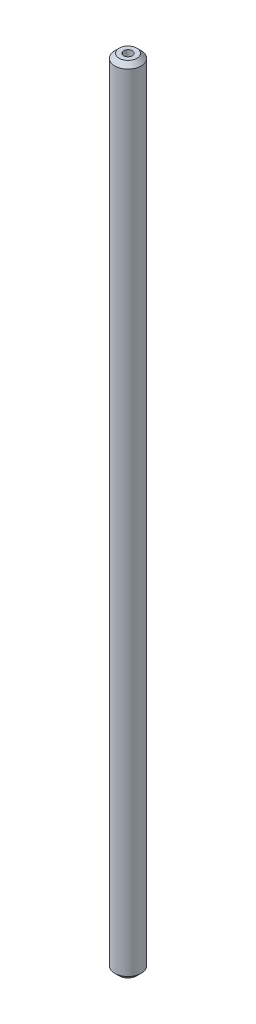
ISO-10303-21;
HEADER;
FILE_DESCRIPTION(('STEP AP214'),'2;1');
FILE_NAME('part.step','',(''),(''),'','','');
FILE_SCHEMA(('AUTOMOTIVE_DESIGN { 1 0 10303 214 1 1 1 1 }'));
ENDSEC;
DATA;
#1=APPLICATION_CONTEXT('core data for automotive mechanical design processes');
#2=APPLICATION_PROTOCOL_DEFINITION('international standard','automotive_design',2000,#1);
#3=PRODUCT_CONTEXT('',#1,'mechanical');
#4=PRODUCT('Part','Part','',(#3));
#5=PRODUCT_RELATED_PRODUCT_CATEGORY('part','',(#4));
#6=PRODUCT_DEFINITION_FORMATION('','',#4);
#7=PRODUCT_DEFINITION_CONTEXT('part definition',#1,'design');
#8=PRODUCT_DEFINITION('design','',#6,#7);
#9=PRODUCT_DEFINITION_SHAPE('','',#8);
#10=(LENGTH_UNIT() NAMED_UNIT(*) SI_UNIT(.MILLI.,.METRE.));
#11=(NAMED_UNIT(*) PLANE_ANGLE_UNIT() SI_UNIT($,.RADIAN.));
#12=(NAMED_UNIT(*) SI_UNIT($,.STERADIAN.) SOLID_ANGLE_UNIT());
#13=UNCERTAINTY_MEASURE_WITH_UNIT(LENGTH_MEASURE(1.E-05),#10,'distance_accuracy_value','');
#14=(GEOMETRIC_REPRESENTATION_CONTEXT(3) GLOBAL_UNCERTAINTY_ASSIGNED_CONTEXT((#13)) GLOBAL_UNIT_ASSIGNED_CONTEXT((#10,
#11,#12)) REPRESENTATION_CONTEXT('',''));
#15=CARTESIAN_POINT('',(0.,0.,0.));
#16=DIRECTION('',(0.,0.,1.));
#17=DIRECTION('',(1.,0.,0.));
#18=AXIS2_PLACEMENT_3D('',#15,#16,#17);
#19=CARTESIAN_POINT('',(0.,90.,0.));
#20=DIRECTION('',(0.,1.,0.));
#21=DIRECTION('',(0.,0.,1.));
#22=AXIS2_PLACEMENT_3D('',#19,#20,#21);
#23=PLANE('',#22);
#24=CARTESIAN_POINT('',(0.,90.,0.));
#25=DIRECTION('',(0.,1.,0.));
#26=DIRECTION('',(0.,0.,1.));
#27=AXIS2_PLACEMENT_3D('',#24,#25,#26);
#28=CIRCLE('',#27,1.00000000000006);
#29=CARTESIAN_POINT('',(0.,90.,1.00000000000006));
#30=VERTEX_POINT('',#29);
#31=EDGE_CURVE('E66',#30,#30,#28,.T.);
#32=ORIENTED_EDGE('',*,*,#31,.T.);
#33=EDGE_LOOP('',(#32));
#34=FACE_BOUND('',#33,.T.);
#35=CARTESIAN_POINT('',(0.,90.,0.));
#36=DIRECTION('',(0.,1.,0.));
#37=DIRECTION('',(0.,0.,1.));
#38=AXIS2_PLACEMENT_3D('',#35,#36,#37);
#39=CIRCLE('',#38,0.5);
#40=CARTESIAN_POINT('',(0.,90.,0.5));
#41=VERTEX_POINT('',#40);
#42=EDGE_CURVE('E72',#41,#41,#39,.T.);
#43=ORIENTED_EDGE('',*,*,#42,.F.);
#44=EDGE_LOOP('',(#43));
#45=FACE_BOUND('',#44,.T.);
#46=ADVANCED_FACE('F47',(#34,#45),#23,.T.);
#47=CARTESIAN_POINT('',(0.,0.,0.));
#48=DIRECTION('',(0.,1.,0.));
#49=DIRECTION('',(0.,0.,1.));
#50=AXIS2_PLACEMENT_3D('',#47,#48,#49);
#51=PLANE('',#50);
#52=CARTESIAN_POINT('',(0.,0.,0.));
#53=DIRECTION('',(0.,1.,0.));
#54=DIRECTION('',(0.,0.,1.));
#55=AXIS2_PLACEMENT_3D('',#52,#53,#54);
#56=CIRCLE('',#55,0.999999999999945);
#57=CARTESIAN_POINT('',(0.,0.,0.999999999999945));
#58=VERTEX_POINT('',#57);
#59=EDGE_CURVE('E10',#58,#58,#56,.F.);
#60=ORIENTED_EDGE('',*,*,#59,.T.);
#61=EDGE_LOOP('',(#60));
#62=FACE_BOUND('',#61,.T.);
#63=CARTESIAN_POINT('',(0.,0.,0.));
#64=DIRECTION('',(0.,1.,0.));
#65=DIRECTION('',(0.,0.,1.));
#66=AXIS2_PLACEMENT_3D('',#63,#64,#65);
#67=CIRCLE('',#66,0.5);
#68=CARTESIAN_POINT('',(0.,0.,0.5));
#69=VERTEX_POINT('',#68);
#70=EDGE_CURVE('E73',#69,#69,#67,.T.);
#71=ORIENTED_EDGE('',*,*,#70,.T.);
#72=EDGE_LOOP('',(#71));
#73=FACE_BOUND('',#72,.T.);
#74=ADVANCED_FACE('F85',(#62,#73),#51,.F.);
#75=CARTESIAN_POINT('',(0.,90.,0.));
#76=DIRECTION('',(0.,-1.,0.));
#77=DIRECTION('',(0.,0.,-1.));
#78=AXIS2_PLACEMENT_3D('',#75,#76,#77);
#79=CYLINDRICAL_SURFACE('',#78,1.5);
#80=CARTESIAN_POINT('',(0.,89.5000000000001,0.));
#81=DIRECTION('',(0.,1.,0.));
#82=DIRECTION('',(0.,0.,1.));
#83=AXIS2_PLACEMENT_3D('',#80,#81,#82);
#84=CIRCLE('',#83,1.5);
#85=CARTESIAN_POINT('',(0.,89.5000000000001,1.5));
#86=VERTEX_POINT('',#85);
#87=EDGE_CURVE('E56',#86,#86,#84,.F.);
#88=ORIENTED_EDGE('',*,*,#87,.T.);
#89=EDGE_LOOP('',(#88));
#90=FACE_BOUND('',#89,.T.);
#91=CARTESIAN_POINT('',(0.,0.500000000000056,0.));
#92=DIRECTION('',(0.,1.,0.));
#93=DIRECTION('',(0.,0.,1.));
#94=AXIS2_PLACEMENT_3D('',#91,#92,#93);
#95=CIRCLE('',#94,1.5);
#96=CARTESIAN_POINT('',(0.,0.500000000000056,1.5));
#97=VERTEX_POINT('',#96);
#98=EDGE_CURVE('E61',#97,#97,#95,.T.);
#99=ORIENTED_EDGE('',*,*,#98,.T.);
#100=EDGE_LOOP('',(#99));
#101=FACE_BOUND('',#100,.T.);
#102=ADVANCED_FACE('F92',(#90,#101),#79,.T.);
#103=CARTESIAN_POINT('',(0.,90.,0.));
#104=DIRECTION('',(0.,-1.,0.));
#105=DIRECTION('',(0.,0.,-1.));
#106=AXIS2_PLACEMENT_3D('',#103,#104,#105);
#107=CYLINDRICAL_SURFACE('',#106,0.5);
#108=ORIENTED_EDGE('',*,*,#42,.T.);
#109=EDGE_LOOP('',(#108));
#110=FACE_BOUND('',#109,.T.);
#111=ORIENTED_EDGE('',*,*,#70,.F.);
#112=EDGE_LOOP('',(#111));
#113=FACE_BOUND('',#112,.T.);
#114=ADVANCED_FACE('F81',(#110,#113),#107,.F.);
#115=CARTESIAN_POINT('',(0.,90.,0.));
#116=DIRECTION('',(0.,-1.,0.));
#117=DIRECTION('',(0.,0.,-1.));
#118=AXIS2_PLACEMENT_3D('',#115,#116,#117);
#119=CONICAL_SURFACE('',#118,1.00000000000006,0.785398163397447);
#120=ORIENTED_EDGE('',*,*,#87,.F.);
#121=EDGE_LOOP('',(#120));
#122=FACE_BOUND('',#121,.T.);
#123=ORIENTED_EDGE('',*,*,#31,.F.);
#124=EDGE_LOOP('',(#123));
#125=FACE_BOUND('',#124,.T.);
#126=ADVANCED_FACE('F98',(#122,#125),#119,.T.);
#127=CARTESIAN_POINT('',(0.,0.500000000000056,0.));
#128=DIRECTION('',(0.,1.,0.));
#129=DIRECTION('',(0.,0.,1.));
#130=AXIS2_PLACEMENT_3D('',#127,#128,#129);
#131=CONICAL_SURFACE('',#130,1.5,0.785398163397447);
#132=ORIENTED_EDGE('',*,*,#59,.F.);
#133=EDGE_LOOP('',(#132));
#134=FACE_BOUND('',#133,.T.);
#135=ORIENTED_EDGE('',*,*,#98,.F.);
#136=EDGE_LOOP('',(#135));
#137=FACE_BOUND('',#136,.T.);
#138=ADVANCED_FACE('F50',(#134,#137),#131,.T.);
#139=CLOSED_SHELL('',(#46,#74,#102,#114,#126,#138));
#140=MANIFOLD_SOLID_BREP('B2',#139);
#141=ADVANCED_BREP_SHAPE_REPRESENTATION('',(#18,#140),#14);
#142=SHAPE_DEFINITION_REPRESENTATION(#9,#141);
ENDSEC;
END-ISO-10303-21;
